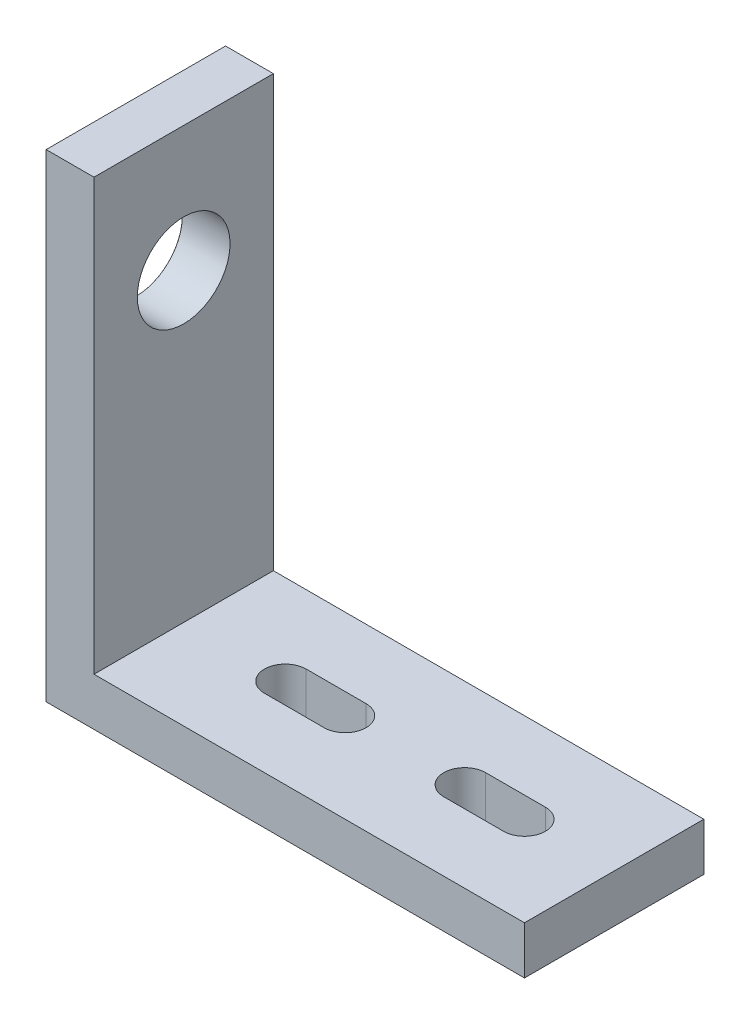
ISO-10303-21;
HEADER;
FILE_DESCRIPTION(('STEP AP214'),'2;1');
FILE_NAME('part.step','',(''),(''),'','','');
FILE_SCHEMA(('AUTOMOTIVE_DESIGN { 1 0 10303 214 1 1 1 1 }'));
ENDSEC;
DATA;
#1=APPLICATION_CONTEXT('core data for automotive mechanical design processes');
#2=APPLICATION_PROTOCOL_DEFINITION('international standard','automotive_design',2000,#1);
#3=PRODUCT_CONTEXT('',#1,'mechanical');
#4=PRODUCT('Part','Part','',(#3));
#5=PRODUCT_RELATED_PRODUCT_CATEGORY('part','',(#4));
#6=PRODUCT_DEFINITION_FORMATION('','',#4);
#7=PRODUCT_DEFINITION_CONTEXT('part definition',#1,'design');
#8=PRODUCT_DEFINITION('design','',#6,#7);
#9=PRODUCT_DEFINITION_SHAPE('','',#8);
#10=(LENGTH_UNIT() NAMED_UNIT(*) SI_UNIT(.MILLI.,.METRE.));
#11=(NAMED_UNIT(*) PLANE_ANGLE_UNIT() SI_UNIT($,.RADIAN.));
#12=(NAMED_UNIT(*) SI_UNIT($,.STERADIAN.) SOLID_ANGLE_UNIT());
#13=UNCERTAINTY_MEASURE_WITH_UNIT(LENGTH_MEASURE(1.E-05),#10,'distance_accuracy_value','');
#14=(GEOMETRIC_REPRESENTATION_CONTEXT(3) GLOBAL_UNCERTAINTY_ASSIGNED_CONTEXT((#13)) GLOBAL_UNIT_ASSIGNED_CONTEXT((#10,
#11,#12)) REPRESENTATION_CONTEXT('',''));
#15=CARTESIAN_POINT('',(0.,0.,0.));
#16=DIRECTION('',(0.,0.,1.));
#17=DIRECTION('',(1.,0.,0.));
#18=AXIS2_PLACEMENT_3D('',#15,#16,#17);
#19=CARTESIAN_POINT('',(0.,80.,30.));
#20=DIRECTION('',(0.,-1.,0.));
#21=DIRECTION('',(0.,0.,-1.));
#22=AXIS2_PLACEMENT_3D('',#19,#20,#21);
#23=PLANE('',#22);
#24=DIRECTION('',(-1.,0.,0.));
#25=VECTOR('',#24,1.);
#26=CARTESIAN_POINT('',(0.,80.,0.));
#27=LINE('',#26,#25);
#28=CARTESIAN_POINT('',(7.99999999999999,80.,0.));
#29=VERTEX_POINT('',#28);
#30=CARTESIAN_POINT('',(0.,80.,0.));
#31=VERTEX_POINT('',#30);
#32=EDGE_CURVE('E206',#29,#31,#27,.T.);
#33=ORIENTED_EDGE('',*,*,#32,.T.);
#34=DIRECTION('',(0.,0.,-1.));
#35=VECTOR('',#34,1.);
#36=CARTESIAN_POINT('',(0.,80.,30.));
#37=LINE('',#36,#35);
#38=CARTESIAN_POINT('',(0.,80.,30.));
#39=VERTEX_POINT('',#38);
#40=EDGE_CURVE('E11',#39,#31,#37,.T.);
#41=ORIENTED_EDGE('',*,*,#40,.F.);
#42=DIRECTION('',(-1.,0.,0.));
#43=VECTOR('',#42,1.);
#44=CARTESIAN_POINT('',(0.,80.,30.));
#45=LINE('',#44,#43);
#46=CARTESIAN_POINT('',(7.99999999999999,80.,30.));
#47=VERTEX_POINT('',#46);
#48=EDGE_CURVE('E207',#47,#39,#45,.T.);
#49=ORIENTED_EDGE('',*,*,#48,.F.);
#50=DIRECTION('',(0.,0.,-1.));
#51=VECTOR('',#50,1.);
#52=CARTESIAN_POINT('',(7.99999999999999,80.,30.));
#53=LINE('',#52,#51);
#54=EDGE_CURVE('E221',#47,#29,#53,.T.);
#55=ORIENTED_EDGE('',*,*,#54,.T.);
#56=EDGE_LOOP('',(#33,#41,#49,#55));
#57=FACE_BOUND('',#56,.T.);
#58=ADVANCED_FACE('F35',(#57),#23,.F.);
#59=CARTESIAN_POINT('',(0.,80.,30.));
#60=DIRECTION('',(1.,0.,0.));
#61=DIRECTION('',(0.,1.,0.));
#62=AXIS2_PLACEMENT_3D('',#59,#60,#61);
#63=PLANE('',#62);
#64=CARTESIAN_POINT('',(0.,59.,15.));
#65=DIRECTION('',(-1.,0.,0.));
#66=DIRECTION('',(0.,0.,1.));
#67=AXIS2_PLACEMENT_3D('',#64,#65,#66);
#68=CIRCLE('',#67,7.775);
#69=CARTESIAN_POINT('',(0.,59.,22.775));
#70=VERTEX_POINT('',#69);
#71=EDGE_CURVE('E435',#70,#70,#68,.T.);
#72=ORIENTED_EDGE('',*,*,#71,.F.);
#73=EDGE_LOOP('',(#72));
#74=FACE_BOUND('',#73,.T.);
#75=DIRECTION('',(0.,-1.,0.));
#76=VECTOR('',#75,1.);
#77=CARTESIAN_POINT('',(0.,80.,0.));
#78=LINE('',#77,#76);
#79=CARTESIAN_POINT('',(0.,0.,0.));
#80=VERTEX_POINT('',#79);
#81=EDGE_CURVE('E224',#31,#80,#78,.T.);
#82=ORIENTED_EDGE('',*,*,#81,.T.);
#83=DIRECTION('',(0.,0.,-1.));
#84=VECTOR('',#83,1.);
#85=CARTESIAN_POINT('',(0.,0.,30.));
#86=LINE('',#85,#84);
#87=CARTESIAN_POINT('',(0.,0.,30.));
#88=VERTEX_POINT('',#87);
#89=EDGE_CURVE('E43',#88,#80,#86,.T.);
#90=ORIENTED_EDGE('',*,*,#89,.F.);
#91=DIRECTION('',(0.,-1.,0.));
#92=VECTOR('',#91,1.);
#93=CARTESIAN_POINT('',(0.,80.,30.));
#94=LINE('',#93,#92);
#95=EDGE_CURVE('E210',#39,#88,#94,.T.);
#96=ORIENTED_EDGE('',*,*,#95,.F.);
#97=ORIENTED_EDGE('',*,*,#40,.T.);
#98=EDGE_LOOP('',(#82,#90,#96,#97));
#99=FACE_BOUND('',#98,.T.);
#100=ADVANCED_FACE('F271',(#74,#99),#63,.F.);
#101=CARTESIAN_POINT('',(0.,0.,30.));
#102=DIRECTION('',(0.,1.,0.));
#103=DIRECTION('',(0.,0.,1.));
#104=AXIS2_PLACEMENT_3D('',#101,#102,#103);
#105=PLANE('',#104);
#106=DIRECTION('',(-1.,0.,0.));
#107=VECTOR('',#106,1.);
#108=CARTESIAN_POINT('',(0.,0.,11.5));
#109=LINE('',#108,#107);
#110=CARTESIAN_POINT('',(65.0000000000001,0.,11.5));
#111=VERTEX_POINT('',#110);
#112=CARTESIAN_POINT('',(55.0000000000001,0.,11.5));
#113=VERTEX_POINT('',#112);
#114=EDGE_CURVE('E200',#111,#113,#109,.T.);
#115=ORIENTED_EDGE('',*,*,#114,.T.);
#116=CARTESIAN_POINT('',(55.0000000000001,0.,15.));
#117=DIRECTION('',(0.,1.,0.));
#118=DIRECTION('',(0.,0.,1.));
#119=AXIS2_PLACEMENT_3D('',#116,#117,#118);
#120=CIRCLE('',#119,3.5);
#121=CARTESIAN_POINT('',(55.0000000000001,0.,18.5));
#122=VERTEX_POINT('',#121);
#123=EDGE_CURVE('E203',#113,#122,#120,.T.);
#124=ORIENTED_EDGE('',*,*,#123,.T.);
#125=DIRECTION('',(1.,0.,0.));
#126=VECTOR('',#125,1.);
#127=CARTESIAN_POINT('',(0.,0.,18.5));
#128=LINE('',#127,#126);
#129=CARTESIAN_POINT('',(65.0000000000001,0.,18.5));
#130=VERTEX_POINT('',#129);
#131=EDGE_CURVE('E197',#122,#130,#128,.T.);
#132=ORIENTED_EDGE('',*,*,#131,.T.);
#133=CARTESIAN_POINT('',(65.0000000000001,0.,15.));
#134=DIRECTION('',(0.,1.,0.));
#135=DIRECTION('',(0.,0.,1.));
#136=AXIS2_PLACEMENT_3D('',#133,#134,#135);
#137=CIRCLE('',#136,3.5);
#138=EDGE_CURVE('E141',#130,#111,#137,.T.);
#139=ORIENTED_EDGE('',*,*,#138,.T.);
#140=EDGE_LOOP('',(#115,#124,#132,#139));
#141=FACE_BOUND('',#140,.T.);
#142=DIRECTION('',(-1.,0.,0.));
#143=VECTOR('',#142,1.);
#144=CARTESIAN_POINT('',(0.,0.,11.5000000000002));
#145=LINE('',#144,#143);
#146=CARTESIAN_POINT('',(35.0000000000001,0.,11.5000000000002));
#147=VERTEX_POINT('',#146);
#148=CARTESIAN_POINT('',(25.0000000000001,0.,11.5000000000002));
#149=VERTEX_POINT('',#148);
#150=EDGE_CURVE('E191',#147,#149,#145,.T.);
#151=ORIENTED_EDGE('',*,*,#150,.T.);
#152=CARTESIAN_POINT('',(25.0000000000001,0.,15.0000000000002));
#153=DIRECTION('',(0.,1.,0.));
#154=DIRECTION('',(0.,0.,1.));
#155=AXIS2_PLACEMENT_3D('',#152,#153,#154);
#156=CIRCLE('',#155,3.49999999999979);
#157=CARTESIAN_POINT('',(25.0000000000001,0.,18.4999999999998));
#158=VERTEX_POINT('',#157);
#159=EDGE_CURVE('E194',#149,#158,#156,.T.);
#160=ORIENTED_EDGE('',*,*,#159,.T.);
#161=DIRECTION('',(1.,0.,0.));
#162=VECTOR('',#161,1.);
#163=CARTESIAN_POINT('',(0.,0.,18.4999999999998));
#164=LINE('',#163,#162);
#165=CARTESIAN_POINT('',(35.0000000000001,0.,18.4999999999998));
#166=VERTEX_POINT('',#165);
#167=EDGE_CURVE('E165',#158,#166,#164,.T.);
#168=ORIENTED_EDGE('',*,*,#167,.T.);
#169=CARTESIAN_POINT('',(35.0000000000001,0.,15.0000000000002));
#170=DIRECTION('',(0.,1.,0.));
#171=DIRECTION('',(0.,0.,1.));
#172=AXIS2_PLACEMENT_3D('',#169,#170,#171);
#173=CIRCLE('',#172,3.49999999999979);
#174=EDGE_CURVE('E188',#166,#147,#173,.T.);
#175=ORIENTED_EDGE('',*,*,#174,.T.);
#176=EDGE_LOOP('',(#151,#160,#168,#175));
#177=FACE_BOUND('',#176,.T.);
#178=DIRECTION('',(1.,0.,0.));
#179=VECTOR('',#178,1.);
#180=CARTESIAN_POINT('',(0.,0.,0.));
#181=LINE('',#180,#179);
#182=CARTESIAN_POINT('',(80.,0.,0.));
#183=VERTEX_POINT('',#182);
#184=EDGE_CURVE('E226',#80,#183,#181,.T.);
#185=ORIENTED_EDGE('',*,*,#184,.T.);
#186=DIRECTION('',(0.,0.,-1.));
#187=VECTOR('',#186,1.);
#188=CARTESIAN_POINT('',(80.,0.,30.));
#189=LINE('',#188,#187);
#190=CARTESIAN_POINT('',(80.,0.,30.));
#191=VERTEX_POINT('',#190);
#192=EDGE_CURVE('E241',#191,#183,#189,.T.);
#193=ORIENTED_EDGE('',*,*,#192,.F.);
#194=DIRECTION('',(1.,0.,0.));
#195=VECTOR('',#194,1.);
#196=CARTESIAN_POINT('',(0.,0.,30.));
#197=LINE('',#196,#195);
#198=EDGE_CURVE('E213',#88,#191,#197,.T.);
#199=ORIENTED_EDGE('',*,*,#198,.F.);
#200=ORIENTED_EDGE('',*,*,#89,.T.);
#201=EDGE_LOOP('',(#185,#193,#199,#200));
#202=FACE_BOUND('',#201,.T.);
#203=ADVANCED_FACE('F249',(#141,#177,#202),#105,.F.);
#204=CARTESIAN_POINT('',(80.,8.,30.));
#205=DIRECTION('',(-1.,0.,0.));
#206=DIRECTION('',(0.,0.,1.));
#207=AXIS2_PLACEMENT_3D('',#204,#205,#206);
#208=PLANE('',#207);
#209=DIRECTION('',(0.,1.,0.));
#210=VECTOR('',#209,1.);
#211=CARTESIAN_POINT('',(80.,8.,0.));
#212=LINE('',#211,#210);
#213=CARTESIAN_POINT('',(80.,8.,0.));
#214=VERTEX_POINT('',#213);
#215=EDGE_CURVE('E228',#183,#214,#212,.T.);
#216=ORIENTED_EDGE('',*,*,#215,.T.);
#217=DIRECTION('',(0.,0.,-1.));
#218=VECTOR('',#217,1.);
#219=CARTESIAN_POINT('',(80.,8.,30.));
#220=LINE('',#219,#218);
#221=CARTESIAN_POINT('',(80.,8.,30.));
#222=VERTEX_POINT('',#221);
#223=EDGE_CURVE('E238',#222,#214,#220,.T.);
#224=ORIENTED_EDGE('',*,*,#223,.F.);
#225=DIRECTION('',(0.,1.,0.));
#226=VECTOR('',#225,1.);
#227=CARTESIAN_POINT('',(80.,8.,30.));
#228=LINE('',#227,#226);
#229=EDGE_CURVE('E215',#191,#222,#228,.T.);
#230=ORIENTED_EDGE('',*,*,#229,.F.);
#231=ORIENTED_EDGE('',*,*,#192,.T.);
#232=EDGE_LOOP('',(#216,#224,#230,#231));
#233=FACE_BOUND('',#232,.T.);
#234=ADVANCED_FACE('F260',(#233),#208,.F.);
#235=CARTESIAN_POINT('',(8.,8.,30.));
#236=DIRECTION('',(0.,-1.,0.));
#237=DIRECTION('',(0.,0.,-1.));
#238=AXIS2_PLACEMENT_3D('',#235,#236,#237);
#239=PLANE('',#238);
#240=DIRECTION('',(1.,0.,0.));
#241=VECTOR('',#240,1.);
#242=CARTESIAN_POINT('',(55.0000000000001,8.,18.5));
#243=LINE('',#242,#241);
#244=CARTESIAN_POINT('',(55.0000000000001,8.,18.5));
#245=VERTEX_POINT('',#244);
#246=CARTESIAN_POINT('',(65.0000000000001,8.,18.5));
#247=VERTEX_POINT('',#246);
#248=EDGE_CURVE('E148',#245,#247,#243,.T.);
#249=ORIENTED_EDGE('',*,*,#248,.F.);
#250=CARTESIAN_POINT('',(55.0000000000001,8.,15.));
#251=DIRECTION('',(0.,1.,0.));
#252=DIRECTION('',(0.,0.,1.));
#253=AXIS2_PLACEMENT_3D('',#250,#251,#252);
#254=CIRCLE('',#253,3.5);
#255=CARTESIAN_POINT('',(55.0000000000001,8.,11.5));
#256=VERTEX_POINT('',#255);
#257=EDGE_CURVE('E153',#256,#245,#254,.T.);
#258=ORIENTED_EDGE('',*,*,#257,.F.);
#259=DIRECTION('',(-1.,0.,0.));
#260=VECTOR('',#259,1.);
#261=CARTESIAN_POINT('',(55.0000000000001,8.,11.5));
#262=LINE('',#261,#260);
#263=CARTESIAN_POINT('',(65.0000000000001,8.,11.5));
#264=VERTEX_POINT('',#263);
#265=EDGE_CURVE('E158',#264,#256,#262,.T.);
#266=ORIENTED_EDGE('',*,*,#265,.F.);
#267=CARTESIAN_POINT('',(65.0000000000001,8.,15.));
#268=DIRECTION('',(0.,1.,0.));
#269=DIRECTION('',(0.,0.,1.));
#270=AXIS2_PLACEMENT_3D('',#267,#268,#269);
#271=CIRCLE('',#270,3.5);
#272=EDGE_CURVE('E138',#247,#264,#271,.T.);
#273=ORIENTED_EDGE('',*,*,#272,.F.);
#274=EDGE_LOOP('',(#249,#258,#266,#273));
#275=FACE_BOUND('',#274,.T.);
#276=DIRECTION('',(1.,0.,0.));
#277=VECTOR('',#276,1.);
#278=CARTESIAN_POINT('',(25.0000000000001,8.,18.4999999999998));
#279=LINE('',#278,#277);
#280=CARTESIAN_POINT('',(25.0000000000001,8.,18.4999999999998));
#281=VERTEX_POINT('',#280);
#282=CARTESIAN_POINT('',(35.0000000000001,8.,18.5));
#283=VERTEX_POINT('',#282);
#284=EDGE_CURVE('E170',#281,#283,#279,.T.);
#285=ORIENTED_EDGE('',*,*,#284,.F.);
#286=CARTESIAN_POINT('',(25.0000000000001,8.,15.0000000000002));
#287=DIRECTION('',(0.,1.,0.));
#288=DIRECTION('',(0.,0.,1.));
#289=AXIS2_PLACEMENT_3D('',#286,#287,#288);
#290=CIRCLE('',#289,3.49999999999979);
#291=CARTESIAN_POINT('',(25.0000000000001,8.,11.5000000000002));
#292=VERTEX_POINT('',#291);
#293=EDGE_CURVE('E168',#292,#281,#290,.T.);
#294=ORIENTED_EDGE('',*,*,#293,.F.);
#295=DIRECTION('',(-1.,0.,0.));
#296=VECTOR('',#295,1.);
#297=CARTESIAN_POINT('',(25.0000000000001,8.,11.5000000000002));
#298=LINE('',#297,#296);
#299=CARTESIAN_POINT('',(35.0000000000001,8.,11.5000000000002));
#300=VERTEX_POINT('',#299);
#301=EDGE_CURVE('E175',#300,#292,#298,.T.);
#302=ORIENTED_EDGE('',*,*,#301,.F.);
#303=CARTESIAN_POINT('',(35.0000000000001,8.,15.0000000000002));
#304=DIRECTION('',(0.,1.,0.));
#305=DIRECTION('',(0.,0.,1.));
#306=AXIS2_PLACEMENT_3D('',#303,#304,#305);
#307=CIRCLE('',#306,3.49999999999979);
#308=EDGE_CURVE('E172',#283,#300,#307,.T.);
#309=ORIENTED_EDGE('',*,*,#308,.F.);
#310=EDGE_LOOP('',(#285,#294,#302,#309));
#311=FACE_BOUND('',#310,.T.);
#312=DIRECTION('',(-1.,0.,0.));
#313=VECTOR('',#312,1.);
#314=CARTESIAN_POINT('',(8.,8.,0.));
#315=LINE('',#314,#313);
#316=CARTESIAN_POINT('',(8.,8.,0.));
#317=VERTEX_POINT('',#316);
#318=EDGE_CURVE('E230',#214,#317,#315,.T.);
#319=ORIENTED_EDGE('',*,*,#318,.T.);
#320=DIRECTION('',(0.,0.,-1.));
#321=VECTOR('',#320,1.);
#322=CARTESIAN_POINT('',(8.,8.,30.));
#323=LINE('',#322,#321);
#324=CARTESIAN_POINT('',(8.,8.,30.));
#325=VERTEX_POINT('',#324);
#326=EDGE_CURVE('E235',#325,#317,#323,.T.);
#327=ORIENTED_EDGE('',*,*,#326,.F.);
#328=DIRECTION('',(-1.,0.,0.));
#329=VECTOR('',#328,1.);
#330=CARTESIAN_POINT('',(8.,8.,30.));
#331=LINE('',#330,#329);
#332=EDGE_CURVE('E217',#222,#325,#331,.T.);
#333=ORIENTED_EDGE('',*,*,#332,.F.);
#334=ORIENTED_EDGE('',*,*,#223,.T.);
#335=EDGE_LOOP('',(#319,#327,#333,#334));
#336=FACE_BOUND('',#335,.T.);
#337=ADVANCED_FACE('F155',(#275,#311,#336),#239,.F.);
#338=CARTESIAN_POINT('',(7.99999999999999,80.,30.));
#339=DIRECTION('',(-1.,0.,0.));
#340=DIRECTION('',(0.,-1.,0.));
#341=AXIS2_PLACEMENT_3D('',#338,#339,#340);
#342=PLANE('',#341);
#343=CARTESIAN_POINT('',(8.,59.,15.));
#344=DIRECTION('',(-1.,0.,0.));
#345=DIRECTION('',(0.,-1.,0.));
#346=AXIS2_PLACEMENT_3D('',#343,#344,#345);
#347=CIRCLE('',#346,7.74999999999999);
#348=CARTESIAN_POINT('',(8.,51.25,15.));
#349=VERTEX_POINT('',#348);
#350=EDGE_CURVE('E38',#349,#349,#347,.T.);
#351=ORIENTED_EDGE('',*,*,#350,.T.);
#352=EDGE_LOOP('',(#351));
#353=FACE_BOUND('',#352,.T.);
#354=DIRECTION('',(0.,1.,0.));
#355=VECTOR('',#354,1.);
#356=CARTESIAN_POINT('',(7.99999999999999,80.,0.));
#357=LINE('',#356,#355);
#358=EDGE_CURVE('E211',#317,#29,#357,.T.);
#359=ORIENTED_EDGE('',*,*,#358,.T.);
#360=ORIENTED_EDGE('',*,*,#54,.F.);
#361=DIRECTION('',(0.,1.,0.));
#362=VECTOR('',#361,1.);
#363=CARTESIAN_POINT('',(7.99999999999999,80.,30.));
#364=LINE('',#363,#362);
#365=EDGE_CURVE('E219',#325,#47,#364,.T.);
#366=ORIENTED_EDGE('',*,*,#365,.F.);
#367=ORIENTED_EDGE('',*,*,#326,.T.);
#368=EDGE_LOOP('',(#359,#360,#366,#367));
#369=FACE_BOUND('',#368,.T.);
#370=ADVANCED_FACE('F274',(#353,#369),#342,.F.);
#371=CARTESIAN_POINT('',(0.,0.,30.));
#372=DIRECTION('',(0.,0.,-1.));
#373=DIRECTION('',(-1.,0.,0.));
#374=AXIS2_PLACEMENT_3D('',#371,#372,#373);
#375=PLANE('',#374);
#376=ORIENTED_EDGE('',*,*,#48,.T.);
#377=ORIENTED_EDGE('',*,*,#95,.T.);
#378=ORIENTED_EDGE('',*,*,#198,.T.);
#379=ORIENTED_EDGE('',*,*,#229,.T.);
#380=ORIENTED_EDGE('',*,*,#332,.T.);
#381=ORIENTED_EDGE('',*,*,#365,.T.);
#382=EDGE_LOOP('',(#376,#377,#378,#379,#380,#381));
#383=FACE_BOUND('',#382,.T.);
#384=ADVANCED_FACE('F267',(#383),#375,.F.);
#385=CARTESIAN_POINT('',(0.,0.,0.));
#386=DIRECTION('',(0.,0.,-1.));
#387=DIRECTION('',(-1.,0.,0.));
#388=AXIS2_PLACEMENT_3D('',#385,#386,#387);
#389=PLANE('',#388);
#390=ORIENTED_EDGE('',*,*,#32,.F.);
#391=ORIENTED_EDGE('',*,*,#358,.F.);
#392=ORIENTED_EDGE('',*,*,#318,.F.);
#393=ORIENTED_EDGE('',*,*,#215,.F.);
#394=ORIENTED_EDGE('',*,*,#184,.F.);
#395=ORIENTED_EDGE('',*,*,#81,.F.);
#396=EDGE_LOOP('',(#390,#391,#392,#393,#394,#395));
#397=FACE_BOUND('',#396,.T.);
#398=ADVANCED_FACE('F255',(#397),#389,.T.);
#399=CARTESIAN_POINT('',(25.0000000000001,-52.,15.0000000000002));
#400=DIRECTION('',(0.,1.,0.));
#401=DIRECTION('',(0.,0.,1.));
#402=AXIS2_PLACEMENT_3D('',#399,#400,#401);
#403=CYLINDRICAL_SURFACE('',#402,3.49999999999979);
#404=DIRECTION('',(0.,1.,0.));
#405=VECTOR('',#404,1.);
#406=CARTESIAN_POINT('',(25.0000000000001,-52.,11.5000000000002));
#407=LINE('',#406,#405);
#408=EDGE_CURVE('E179',#149,#292,#407,.T.);
#409=ORIENTED_EDGE('',*,*,#408,.T.);
#410=ORIENTED_EDGE('',*,*,#293,.T.);
#411=DIRECTION('',(0.,1.,0.));
#412=VECTOR('',#411,1.);
#413=CARTESIAN_POINT('',(25.0000000000001,-52.,18.4999999999998));
#414=LINE('',#413,#412);
#415=EDGE_CURVE('E178',#158,#281,#414,.T.);
#416=ORIENTED_EDGE('',*,*,#415,.F.);
#417=ORIENTED_EDGE('',*,*,#159,.F.);
#418=EDGE_LOOP('',(#409,#410,#416,#417));
#419=FACE_BOUND('',#418,.T.);
#420=ADVANCED_FACE('F317',(#419),#403,.F.);
#421=CARTESIAN_POINT('',(25.0000000000001,-52.,11.5000000000002));
#422=DIRECTION('',(0.,0.,-1.));
#423=DIRECTION('',(-1.,0.,0.));
#424=AXIS2_PLACEMENT_3D('',#421,#422,#423);
#425=PLANE('',#424);
#426=DIRECTION('',(0.,1.,0.));
#427=VECTOR('',#426,1.);
#428=CARTESIAN_POINT('',(35.0000000000001,-52.,11.5000000000002));
#429=LINE('',#428,#427);
#430=EDGE_CURVE('E181',#147,#300,#429,.T.);
#431=ORIENTED_EDGE('',*,*,#430,.T.);
#432=ORIENTED_EDGE('',*,*,#301,.T.);
#433=ORIENTED_EDGE('',*,*,#408,.F.);
#434=ORIENTED_EDGE('',*,*,#150,.F.);
#435=EDGE_LOOP('',(#431,#432,#433,#434));
#436=FACE_BOUND('',#435,.T.);
#437=ADVANCED_FACE('F322',(#436),#425,.F.);
#438=CARTESIAN_POINT('',(35.0000000000001,-52.,15.0000000000002));
#439=DIRECTION('',(0.,1.,0.));
#440=DIRECTION('',(0.,0.,1.));
#441=AXIS2_PLACEMENT_3D('',#438,#439,#440);
#442=CYLINDRICAL_SURFACE('',#441,3.49999999999979);
#443=DIRECTION('',(0.,1.,0.));
#444=VECTOR('',#443,1.);
#445=CARTESIAN_POINT('',(35.0000000000001,-52.,18.5));
#446=LINE('',#445,#444);
#447=EDGE_CURVE('E58',#166,#283,#446,.T.);
#448=ORIENTED_EDGE('',*,*,#447,.T.);
#449=ORIENTED_EDGE('',*,*,#308,.T.);
#450=ORIENTED_EDGE('',*,*,#430,.F.);
#451=ORIENTED_EDGE('',*,*,#174,.F.);
#452=EDGE_LOOP('',(#448,#449,#450,#451));
#453=FACE_BOUND('',#452,.T.);
#454=ADVANCED_FACE('F334',(#453),#442,.F.);
#455=CARTESIAN_POINT('',(25.0000000000001,-52.,18.4999999999998));
#456=DIRECTION('',(0.,0.,1.));
#457=DIRECTION('',(1.,0.,0.));
#458=AXIS2_PLACEMENT_3D('',#455,#456,#457);
#459=PLANE('',#458);
#460=ORIENTED_EDGE('',*,*,#415,.T.);
#461=ORIENTED_EDGE('',*,*,#284,.T.);
#462=ORIENTED_EDGE('',*,*,#447,.F.);
#463=ORIENTED_EDGE('',*,*,#167,.F.);
#464=EDGE_LOOP('',(#460,#461,#462,#463));
#465=FACE_BOUND('',#464,.T.);
#466=ADVANCED_FACE('F344',(#465),#459,.F.);
#467=CARTESIAN_POINT('',(55.0000000000001,-52.,15.));
#468=DIRECTION('',(0.,1.,0.));
#469=DIRECTION('',(0.,0.,1.));
#470=AXIS2_PLACEMENT_3D('',#467,#468,#469);
#471=CYLINDRICAL_SURFACE('',#470,3.5);
#472=DIRECTION('',(0.,1.,0.));
#473=VECTOR('',#472,1.);
#474=CARTESIAN_POINT('',(55.0000000000001,-52.,11.5));
#475=LINE('',#474,#473);
#476=EDGE_CURVE('E163',#113,#256,#475,.T.);
#477=ORIENTED_EDGE('',*,*,#476,.T.);
#478=ORIENTED_EDGE('',*,*,#257,.T.);
#479=DIRECTION('',(0.,1.,0.));
#480=VECTOR('',#479,1.);
#481=CARTESIAN_POINT('',(55.0000000000001,-52.,18.5));
#482=LINE('',#481,#480);
#483=EDGE_CURVE('E144',#122,#245,#482,.T.);
#484=ORIENTED_EDGE('',*,*,#483,.F.);
#485=ORIENTED_EDGE('',*,*,#123,.F.);
#486=EDGE_LOOP('',(#477,#478,#484,#485));
#487=FACE_BOUND('',#486,.T.);
#488=ADVANCED_FACE('F354',(#487),#471,.F.);
#489=CARTESIAN_POINT('',(55.0000000000001,-52.,11.5));
#490=DIRECTION('',(0.,0.,-1.));
#491=DIRECTION('',(-1.,0.,0.));
#492=AXIS2_PLACEMENT_3D('',#489,#490,#491);
#493=PLANE('',#492);
#494=DIRECTION('',(0.,1.,0.));
#495=VECTOR('',#494,1.);
#496=CARTESIAN_POINT('',(65.0000000000001,-52.,11.5));
#497=LINE('',#496,#495);
#498=EDGE_CURVE('E143',#111,#264,#497,.T.);
#499=ORIENTED_EDGE('',*,*,#498,.T.);
#500=ORIENTED_EDGE('',*,*,#265,.T.);
#501=ORIENTED_EDGE('',*,*,#476,.F.);
#502=ORIENTED_EDGE('',*,*,#114,.F.);
#503=EDGE_LOOP('',(#499,#500,#501,#502));
#504=FACE_BOUND('',#503,.T.);
#505=ADVANCED_FACE('F363',(#504),#493,.F.);
#506=CARTESIAN_POINT('',(65.0000000000001,-52.,15.));
#507=DIRECTION('',(0.,1.,0.));
#508=DIRECTION('',(0.,0.,1.));
#509=AXIS2_PLACEMENT_3D('',#506,#507,#508);
#510=CYLINDRICAL_SURFACE('',#509,3.5);
#511=DIRECTION('',(0.,1.,0.));
#512=VECTOR('',#511,1.);
#513=CARTESIAN_POINT('',(65.0000000000001,-52.,18.5));
#514=LINE('',#513,#512);
#515=EDGE_CURVE('E50',#130,#247,#514,.T.);
#516=ORIENTED_EDGE('',*,*,#515,.T.);
#517=ORIENTED_EDGE('',*,*,#272,.T.);
#518=ORIENTED_EDGE('',*,*,#498,.F.);
#519=ORIENTED_EDGE('',*,*,#138,.F.);
#520=EDGE_LOOP('',(#516,#517,#518,#519));
#521=FACE_BOUND('',#520,.T.);
#522=ADVANCED_FACE('F135',(#521),#510,.F.);
#523=CARTESIAN_POINT('',(55.0000000000001,-52.,18.5));
#524=DIRECTION('',(0.,0.,1.));
#525=DIRECTION('',(1.,0.,0.));
#526=AXIS2_PLACEMENT_3D('',#523,#524,#525);
#527=PLANE('',#526);
#528=ORIENTED_EDGE('',*,*,#483,.T.);
#529=ORIENTED_EDGE('',*,*,#248,.T.);
#530=ORIENTED_EDGE('',*,*,#515,.F.);
#531=ORIENTED_EDGE('',*,*,#131,.F.);
#532=EDGE_LOOP('',(#528,#529,#530,#531));
#533=FACE_BOUND('',#532,.T.);
#534=ADVANCED_FACE('F149',(#533),#527,.F.);
#535=CARTESIAN_POINT('',(0.,59.,15.));
#536=DIRECTION('',(-1.,0.,0.));
#537=DIRECTION('',(0.,0.,1.));
#538=AXIS2_PLACEMENT_3D('',#535,#536,#537);
#539=CYLINDRICAL_SURFACE('',#538,7.74999999999999);
#540=CARTESIAN_POINT('',(0.0250000000000002,59.,15.));
#541=DIRECTION('',(-1.,0.,0.));
#542=DIRECTION('',(0.,0.,1.));
#543=AXIS2_PLACEMENT_3D('',#540,#541,#542);
#544=CIRCLE('',#543,7.74999999999999);
#545=CARTESIAN_POINT('',(0.0250000000000002,59.,22.75));
#546=VERTEX_POINT('',#545);
#547=EDGE_CURVE('E433',#546,#546,#544,.T.);
#548=ORIENTED_EDGE('',*,*,#547,.T.);
#549=EDGE_LOOP('',(#548));
#550=FACE_BOUND('',#549,.T.);
#551=ORIENTED_EDGE('',*,*,#350,.F.);
#552=EDGE_LOOP('',(#551));
#553=FACE_BOUND('',#552,.T.);
#554=ADVANCED_FACE('F389',(#550,#553),#539,.F.);
#555=CARTESIAN_POINT('',(0.,59.,15.));
#556=DIRECTION('',(-1.,0.,0.));
#557=DIRECTION('',(0.,0.,1.));
#558=AXIS2_PLACEMENT_3D('',#555,#556,#557);
#559=CONICAL_SURFACE('',#558,7.775,0.785398163397604);
#560=ORIENTED_EDGE('',*,*,#547,.F.);
#561=EDGE_LOOP('',(#560));
#562=FACE_BOUND('',#561,.T.);
#563=ORIENTED_EDGE('',*,*,#71,.T.);
#564=EDGE_LOOP('',(#563));
#565=FACE_BOUND('',#564,.T.);
#566=ADVANCED_FACE('F408',(#562,#565),#559,.F.);
#567=CLOSED_SHELL('',(#58,#100,#203,#234,#337,#370,#384,#398,#420,#437,#454,#466,#488,#505,#522,
#534,#554,#566));
#568=MANIFOLD_SOLID_BREP('B2',#567);
#569=ADVANCED_BREP_SHAPE_REPRESENTATION('',(#18,#568),#14);
#570=SHAPE_DEFINITION_REPRESENTATION(#9,#569);
ENDSEC;
END-ISO-10303-21;
